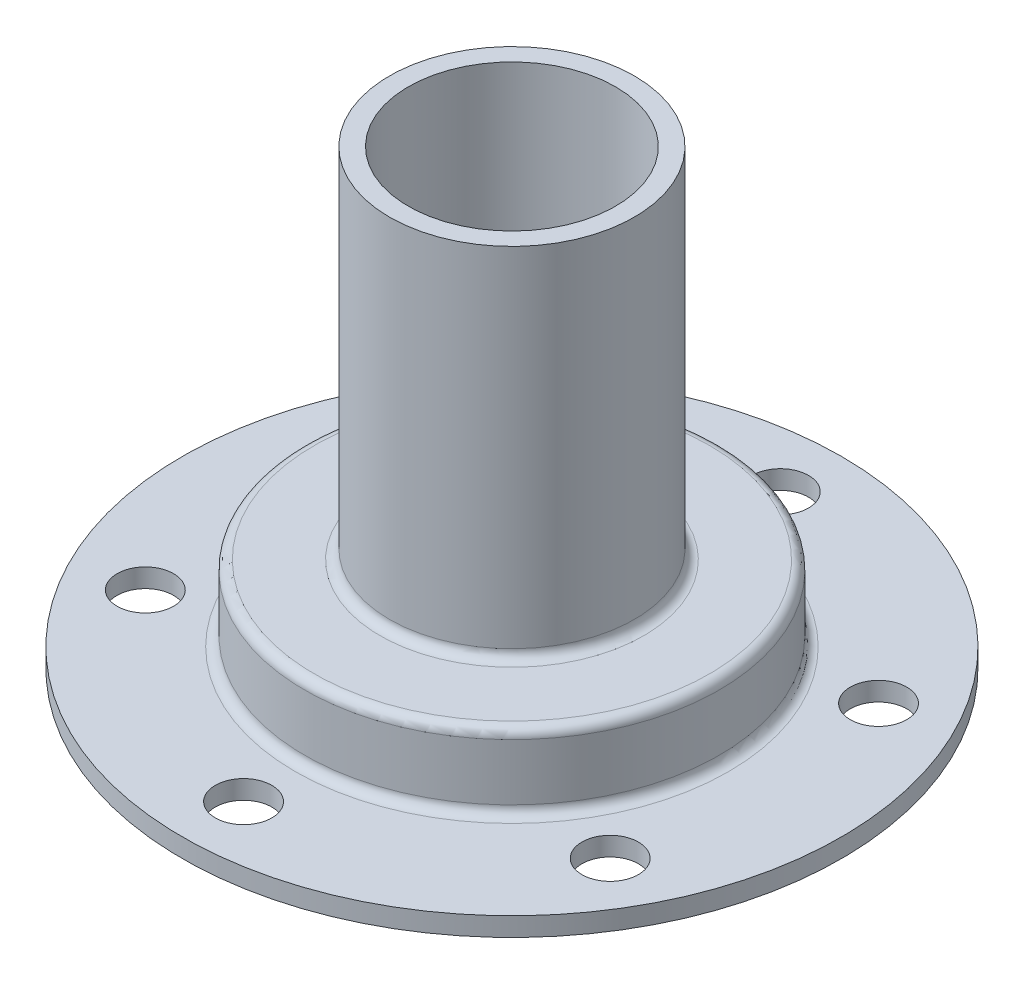
ISO-10303-21;
HEADER;
FILE_DESCRIPTION(('STEP AP214'),'2;1');
FILE_NAME('part.step','',(''),(''),'','','');
FILE_SCHEMA(('AUTOMOTIVE_DESIGN { 1 0 10303 214 1 1 1 1 }'));
ENDSEC;
DATA;
#1=APPLICATION_CONTEXT('core data for automotive mechanical design processes');
#2=APPLICATION_PROTOCOL_DEFINITION('international standard','automotive_design',2000,#1);
#3=PRODUCT_CONTEXT('',#1,'mechanical');
#4=PRODUCT('Part','Part','',(#3));
#5=PRODUCT_RELATED_PRODUCT_CATEGORY('part','',(#4));
#6=PRODUCT_DEFINITION_FORMATION('','',#4);
#7=PRODUCT_DEFINITION_CONTEXT('part definition',#1,'design');
#8=PRODUCT_DEFINITION('design','',#6,#7);
#9=PRODUCT_DEFINITION_SHAPE('','',#8);
#10=(LENGTH_UNIT() NAMED_UNIT(*) SI_UNIT(.MILLI.,.METRE.));
#11=(NAMED_UNIT(*) PLANE_ANGLE_UNIT() SI_UNIT($,.RADIAN.));
#12=(NAMED_UNIT(*) SI_UNIT($,.STERADIAN.) SOLID_ANGLE_UNIT());
#13=UNCERTAINTY_MEASURE_WITH_UNIT(LENGTH_MEASURE(1.E-05),#10,'distance_accuracy_value','');
#14=(GEOMETRIC_REPRESENTATION_CONTEXT(3) GLOBAL_UNCERTAINTY_ASSIGNED_CONTEXT((#13)) GLOBAL_UNIT_ASSIGNED_CONTEXT((#10,
#11,#12)) REPRESENTATION_CONTEXT('',''));
#15=CARTESIAN_POINT('',(0.,0.,0.));
#16=DIRECTION('',(0.,0.,1.));
#17=DIRECTION('',(1.,0.,0.));
#18=AXIS2_PLACEMENT_3D('',#15,#16,#17);
#19=CARTESIAN_POINT('',(0.,0.,0.));
#20=DIRECTION('',(0.,-1.,0.));
#21=DIRECTION('',(0.,0.,-1.));
#22=AXIS2_PLACEMENT_3D('',#19,#20,#21);
#23=CYLINDRICAL_SURFACE('',#22,20.);
#24=CARTESIAN_POINT('',(0.,0.,0.));
#25=DIRECTION('',(0.,-1.,0.));
#26=DIRECTION('',(0.,0.,-1.));
#27=AXIS2_PLACEMENT_3D('',#24,#25,#26);
#28=CIRCLE('',#27,20.);
#29=CARTESIAN_POINT('',(0.,0.,-20.));
#30=VERTEX_POINT('',#29);
#31=EDGE_CURVE('E82',#30,#30,#28,.T.);
#32=ORIENTED_EDGE('',*,*,#31,.T.);
#33=EDGE_LOOP('',(#32));
#34=FACE_BOUND('',#33,.T.);
#35=CARTESIAN_POINT('',(0.,6.99999999999999,0.));
#36=DIRECTION('',(0.,-1.,0.));
#37=DIRECTION('',(0.,0.,-1.));
#38=AXIS2_PLACEMENT_3D('',#35,#36,#37);
#39=CIRCLE('',#38,20.);
#40=CARTESIAN_POINT('',(0.,6.99999999999999,-20.));
#41=VERTEX_POINT('',#40);
#42=EDGE_CURVE('E10',#41,#41,#39,.T.);
#43=ORIENTED_EDGE('',*,*,#42,.F.);
#44=EDGE_LOOP('',(#43));
#45=FACE_BOUND('',#44,.T.);
#46=ADVANCED_FACE('F32',(#34,#45),#23,.F.);
#47=CARTESIAN_POINT('',(0.,7.,0.));
#48=DIRECTION('',(0.,-1.,0.));
#49=DIRECTION('',(0.,0.,-1.));
#50=AXIS2_PLACEMENT_3D('',#47,#48,#49);
#51=TOROIDAL_SURFACE('',#50,19.,1.);
#52=ORIENTED_EDGE('',*,*,#42,.T.);
#53=EDGE_LOOP('',(#52));
#54=FACE_BOUND('',#53,.T.);
#55=CARTESIAN_POINT('',(0.,8.,0.));
#56=DIRECTION('',(0.,-1.,0.));
#57=DIRECTION('',(0.,0.,-1.));
#58=AXIS2_PLACEMENT_3D('',#55,#56,#57);
#59=CIRCLE('',#58,19.);
#60=CARTESIAN_POINT('',(0.,8.,-19.));
#61=VERTEX_POINT('',#60);
#62=EDGE_CURVE('E43',#61,#61,#59,.T.);
#63=ORIENTED_EDGE('',*,*,#62,.F.);
#64=EDGE_LOOP('',(#63));
#65=FACE_BOUND('',#64,.T.);
#66=ADVANCED_FACE('F205',(#54,#65),#51,.F.);
#67=CARTESIAN_POINT('',(11.,8.,0.));
#68=DIRECTION('',(0.,-1.,0.));
#69=DIRECTION('',(0.,0.,-1.));
#70=AXIS2_PLACEMENT_3D('',#67,#68,#69);
#71=PLANE('',#70);
#72=ORIENTED_EDGE('',*,*,#62,.T.);
#73=EDGE_LOOP('',(#72));
#74=FACE_BOUND('',#73,.T.);
#75=CARTESIAN_POINT('',(0.,8.,0.));
#76=DIRECTION('',(0.,-1.,0.));
#77=DIRECTION('',(0.,0.,-1.));
#78=AXIS2_PLACEMENT_3D('',#75,#76,#77);
#79=CIRCLE('',#78,11.);
#80=CARTESIAN_POINT('',(0.,8.,-11.));
#81=VERTEX_POINT('',#80);
#82=EDGE_CURVE('E47',#81,#81,#79,.T.);
#83=ORIENTED_EDGE('',*,*,#82,.F.);
#84=EDGE_LOOP('',(#83));
#85=FACE_BOUND('',#84,.T.);
#86=ADVANCED_FACE('F201',(#74,#85),#71,.T.);
#87=CARTESIAN_POINT('',(0.,0.,0.));
#88=DIRECTION('',(0.,-1.,0.));
#89=DIRECTION('',(0.,0.,-1.));
#90=AXIS2_PLACEMENT_3D('',#87,#88,#89);
#91=CYLINDRICAL_SURFACE('',#90,11.);
#92=CARTESIAN_POINT('',(-10.7121426428143,31.3359961877295,-2.5));
#93=CARTESIAN_POINT('',(-10.7121454314233,31.4744623786841,-2.49999543238962));
#94=CARTESIAN_POINT('',(-10.7148566472694,31.6129822700667,-2.48845712333954));
#95=CARTESIAN_POINT('',(-10.7253866484904,31.8860727627859,-2.44266520236751));
#96=CARTESIAN_POINT('',(-10.7332089369474,32.020640589264,-2.40839601066357));
#97=CARTESIAN_POINT('',(-10.7530304465066,32.281837246103,-2.31828540377217));
#98=CARTESIAN_POINT('',(-10.7650248735991,32.4084749923145,-2.26246873972878));
#99=CARTESIAN_POINT('',(-10.7918333757398,32.6505945874108,-2.13091974990439));
#100=CARTESIAN_POINT('',(-10.8066474399211,32.7660764792877,-2.05518750087741));
#101=CARTESIAN_POINT('',(-10.8377278041731,32.9847116686004,-1.88448528035886));
#102=CARTESIAN_POINT('',(-10.8540139214629,33.0876319681401,-1.78922044020224));
#103=CARTESIAN_POINT('',(-10.8860302886159,33.2761786928387,-1.58279346057436));
#104=CARTESIAN_POINT('',(-10.9017604930117,33.3618037061239,-1.4716300245101));
#105=CARTESIAN_POINT('',(-10.93110941005,33.5142592360016,-1.23499021284435));
#106=CARTESIAN_POINT('',(-10.9447020098483,33.5808643881602,-1.10936512825883));
#107=CARTESIAN_POINT('',(-10.9680197641523,33.6919296061426,-0.84834385563644));
#108=CARTESIAN_POINT('',(-10.9777453878714,33.7363923588599,-0.712948855424521));
#109=CARTESIAN_POINT('',(-10.992093320832,33.8011742834783,-0.438655593897397));
#110=CARTESIAN_POINT('',(-10.9967989680676,33.821888165087,-0.299854987503796));
#111=CARTESIAN_POINT('',(-11.0008659279287,33.8398197208107,-0.0206744590410414));
#112=CARTESIAN_POINT('',(-11.0002278985982,33.8370402879955,0.119705266442305));
#113=CARTESIAN_POINT('',(-10.9937426547597,33.8083554591561,0.395333870912044));
#114=CARTESIAN_POINT('',(-10.9879913110538,33.7828756597158,0.530629631624531));
#115=CARTESIAN_POINT('',(-10.972035500945,33.7101931080781,0.794973031158362));
#116=CARTESIAN_POINT('',(-10.9618308229987,33.6629893239362,0.92402037284203));
#117=CARTESIAN_POINT('',(-10.9379627182996,33.5478307778624,1.17336944375684));
#118=CARTESIAN_POINT('',(-10.9242729764965,33.4797172869938,1.29359524399307));
#119=CARTESIAN_POINT('',(-10.8949317146097,33.3247916757736,1.52106399956616));
#120=CARTESIAN_POINT('',(-10.8792799076932,33.2379768201476,1.62830505215688));
#121=CARTESIAN_POINT('',(-10.8473171066438,33.0458047720662,1.82929354427354));
#122=CARTESIAN_POINT('',(-10.8309992019581,32.9400751769291,1.92268414978478));
#123=CARTESIAN_POINT('',(-10.7998704044976,32.7142853719921,2.09047920073132));
#124=CARTESIAN_POINT('',(-10.7850595594488,32.5942247086145,2.16488304500243));
#125=CARTESIAN_POINT('',(-10.7586016791364,32.3425721996198,2.29276887377835));
#126=CARTESIAN_POINT('',(-10.7469656031437,32.2109424338097,2.3461786596901));
#127=CARTESIAN_POINT('',(-10.7283231226734,31.9402476339902,2.43000958929392));
#128=CARTESIAN_POINT('',(-10.7213159185924,31.8011838886342,2.46043470354816));
#129=CARTESIAN_POINT('',(-10.7128889420635,31.5228419400677,2.49686920193376));
#130=CARTESIAN_POINT('',(-10.7113498101725,31.3836355549158,2.50340025202095));
#131=CARTESIAN_POINT('',(-10.7137104989267,31.1061229795842,2.49327772715816));
#132=CARTESIAN_POINT('',(-10.7176099135701,30.9678167229819,2.47662588287242));
#133=CARTESIAN_POINT('',(-10.7302951733771,30.6978778939211,2.42106417661717));
#134=CARTESIAN_POINT('',(-10.7390169712549,30.5661820209237,2.38244586746638));
#135=CARTESIAN_POINT('',(-10.7603057031402,30.3111305952988,2.28436509536444));
#136=CARTESIAN_POINT('',(-10.7728730289421,30.1877758940603,2.22490050843923));
#137=CARTESIAN_POINT('',(-10.8006961734274,29.9506631486902,2.08568096094998));
#138=CARTESIAN_POINT('',(-10.8159929667106,29.8370972486886,2.00560710889276));
#139=CARTESIAN_POINT('',(-10.847445444588,29.6248228844835,1.82785558175614));
#140=CARTESIAN_POINT('',(-10.8636012445728,29.5261164232109,1.73017553739798));
#141=CARTESIAN_POINT('',(-10.8953477425749,29.3443150897137,1.51761489811828));
#142=CARTESIAN_POINT('',(-10.9109203453324,29.2615772630087,1.40242575322726));
#143=CARTESIAN_POINT('',(-10.9394030007809,29.1166253734245,1.15948167628699));
#144=CARTESIAN_POINT('',(-10.9523131827213,29.054410314164,1.03172735466865));
#145=CARTESIAN_POINT('',(-10.9739405859898,28.9527557766496,0.768105049315912));
#146=CARTESIAN_POINT('',(-10.9826854368624,28.9131658603306,0.632297446270902));
#147=CARTESIAN_POINT('',(-10.9951167589318,28.8574196403752,0.355736283082477));
#148=CARTESIAN_POINT('',(-10.9988040274401,28.8412596430652,0.214983506118724));
#149=CARTESIAN_POINT('',(-11.0006787302882,28.8330090715576,-0.0640926427285491));
#150=CARTESIAN_POINT('',(-10.9989875888252,28.8403871092236,-0.202399752438727));
#151=CARTESIAN_POINT('',(-10.9905580161125,28.8778071364077,-0.475747789729384));
#152=CARTESIAN_POINT('',(-10.9838196900264,28.9078486537076,-0.6107887853024));
#153=CARTESIAN_POINT('',(-10.96606448264,28.9894798269408,-0.87332203421874));
#154=CARTESIAN_POINT('',(-10.9550636655368,29.0409886328309,-1.00084058283969));
#155=CARTESIAN_POINT('',(-10.9299536917879,29.1640154145897,-1.24549315867952));
#156=CARTESIAN_POINT('',(-10.9158442081789,29.2355354954173,-1.36262609174177));
#157=CARTESIAN_POINT('',(-10.8856935133435,29.3982581523724,-1.58575630284182));
#158=CARTESIAN_POINT('',(-10.8696188788032,29.4898311021267,-1.69147898146279));
#159=CARTESIAN_POINT('',(-10.8375213996161,29.6893201580273,-1.88623829979112));
#160=CARTESIAN_POINT('',(-10.8214985685478,29.7972402423146,-1.97527086605942));
#161=CARTESIAN_POINT('',(-10.7910549272231,30.0282681815464,-2.13539007203787));
#162=CARTESIAN_POINT('',(-10.7766611159887,30.151575900585,-2.2061937971019));
#163=CARTESIAN_POINT('',(-10.7514502387736,30.4086450389865,-2.32596037579883));
#164=CARTESIAN_POINT('',(-10.7406302556445,30.5423978217097,-2.37494105401434));
#165=CARTESIAN_POINT('',(-10.72571344068,30.7861641451996,-2.44129910462464));
#166=CARTESIAN_POINT('',(-10.7206593017667,30.8948923603032,-2.46326828297558));
#167=CARTESIAN_POINT('',(-10.7138728814852,31.114401059539,-2.49262014337059));
#168=CARTESIAN_POINT('',(-10.712140411085,31.2251814265234,-2.50000365546745));
#169=CARTESIAN_POINT('',(-10.7121426428143,31.3359961877295,-2.5));
#170=B_SPLINE_CURVE_WITH_KNOTS('',3,(#92,#93,#94,#95,#96,#97,#98,#99,#100,#101,#102,#103,#104,
#105,#106,#107,#108,#109,#110,#111,#112,#113,#114,#115,#116,#117,#118,#119,#120,#121,#122,#123,
#124,#125,#126,#127,#128,#129,#130,#131,#132,#133,#134,#135,#136,#137,#138,#139,#140,#141,#142,
#143,#144,#145,#146,#147,#148,#149,#150,#151,#152,#153,#154,#155,#156,#157,#158,#159,#160,#161,
#162,#163,#164,#165,#166,#167,#168,#169),.UNSPECIFIED.,.T.,.F.,(4,2,2,2,2,2,2,2,2,2,2,2,2,2,2,2,
2,2,2,2,2,2,2,2,2,2,2,2,2,2,2,2,2,2,2,2,2,2,4),(0.,0.414992243301633,0.830269217244779,
1.24507058357679,1.65987035130106,2.08146637272044,2.5030967965796,2.92953338750109,
3.35591821939513,3.77510878183785,4.19424772406961,4.60569006667321,5.01715195585207,
5.43181796836808,5.84654467145158,6.27057865094874,6.69462605466424,7.12011925968861,
7.54553894468119,7.96161330230366,8.37765660054312,8.78830262277904,9.19899049685669,
9.61646120958421,10.0339881436657,10.4599792598124,10.8859496910277,11.3090538013157,
11.7320912029453,12.1456463784943,12.5591929374091,12.9711958750873,13.3832421670976,
13.8036601623803,14.2241806329332,14.6508801056332,15.0772304178392,15.4093684172414,
15.7414875145232),.UNSPECIFIED.);
#171=CARTESIAN_POINT('',(-10.7121426428143,31.3359961877295,-2.5));
#172=VERTEX_POINT('',#171);
#173=EDGE_CURVE('E119',#172,#172,#170,.T.);
#174=ORIENTED_EDGE('',*,*,#173,.F.);
#175=EDGE_LOOP('',(#174));
#176=FACE_BOUND('',#175,.T.);
#177=ORIENTED_EDGE('',*,*,#82,.T.);
#178=EDGE_LOOP('',(#177));
#179=FACE_BOUND('',#178,.T.);
#180=CARTESIAN_POINT('',(0.,48.,0.));
#181=DIRECTION('',(0.,-1.,0.));
#182=DIRECTION('',(0.,0.,-1.));
#183=AXIS2_PLACEMENT_3D('',#180,#181,#182);
#184=CIRCLE('',#183,11.);
#185=CARTESIAN_POINT('',(0.,48.,-11.));
#186=VERTEX_POINT('',#185);
#187=EDGE_CURVE('E52',#186,#186,#184,.T.);
#188=ORIENTED_EDGE('',*,*,#187,.F.);
#189=EDGE_LOOP('',(#188));
#190=FACE_BOUND('',#189,.T.);
#191=ADVANCED_FACE('F126',(#176,#179,#190),#91,.F.);
#192=CARTESIAN_POINT('',(13.,48.,0.));
#193=DIRECTION('',(0.,1.,0.));
#194=DIRECTION('',(0.,0.,1.));
#195=AXIS2_PLACEMENT_3D('',#192,#193,#194);
#196=PLANE('',#195);
#197=ORIENTED_EDGE('',*,*,#187,.T.);
#198=EDGE_LOOP('',(#197));
#199=FACE_BOUND('',#198,.T.);
#200=CARTESIAN_POINT('',(0.,48.,0.));
#201=DIRECTION('',(0.,-1.,0.));
#202=DIRECTION('',(0.,0.,-1.));
#203=AXIS2_PLACEMENT_3D('',#200,#201,#202);
#204=CIRCLE('',#203,13.);
#205=CARTESIAN_POINT('',(0.,48.,-13.));
#206=VERTEX_POINT('',#205);
#207=EDGE_CURVE('E55',#206,#206,#204,.T.);
#208=ORIENTED_EDGE('',*,*,#207,.F.);
#209=EDGE_LOOP('',(#208));
#210=FACE_BOUND('',#209,.T.);
#211=ADVANCED_FACE('F194',(#199,#210),#196,.T.);
#212=CARTESIAN_POINT('',(0.,0.,0.));
#213=DIRECTION('',(0.,-1.,0.));
#214=DIRECTION('',(0.,0.,-1.));
#215=AXIS2_PLACEMENT_3D('',#212,#213,#214);
#216=CYLINDRICAL_SURFACE('',#215,13.);
#217=CARTESIAN_POINT('',(-12.7573508221731,31.3359961877295,-2.5));
#218=CARTESIAN_POINT('',(-12.7573535445971,31.1969703279681,-2.49999473771111));
#219=CARTESIAN_POINT('',(-12.759648106677,31.0578769575464,-2.48836372459743));
#220=CARTESIAN_POINT('',(-12.7685662321878,30.7836171288442,-2.44218113719486));
#221=CARTESIAN_POINT('',(-12.7751933891363,30.648454027671,-2.40761053611891));
#222=CARTESIAN_POINT('',(-12.7919990068767,30.3860625429872,-2.31665374663639));
#223=CARTESIAN_POINT('',(-12.8021740742201,30.258826713905,-2.26028839852833));
#224=CARTESIAN_POINT('',(-12.8249250156472,30.0156236377905,-2.12739803553043));
#225=CARTESIAN_POINT('',(-12.8375007225812,29.8996556070614,-2.05087442406184));
#226=CARTESIAN_POINT('',(-12.8638197867113,29.6807549752933,-1.87877245822431));
#227=CARTESIAN_POINT('',(-12.8775751102276,29.5779912382213,-1.78298111863696));
#228=CARTESIAN_POINT('',(-12.90459798027,29.3898886575819,-1.5755231225806));
#229=CARTESIAN_POINT('',(-12.9178654939172,29.304550986785,-1.46385539849172));
#230=CARTESIAN_POINT('',(-12.9425463769484,29.1530727774719,-1.22670187107625));
#231=CARTESIAN_POINT('',(-12.9539439985905,29.0870919290245,-1.10111228887017));
#232=CARTESIAN_POINT('',(-12.9734667695503,28.9772297624023,-0.840374478610756));
#233=CARTESIAN_POINT('',(-12.9815922019259,28.9333465326097,-0.705227078537798));
#234=CARTESIAN_POINT('',(-12.9935705508999,28.8694487842239,-0.430960845173451));
#235=CARTESIAN_POINT('',(-12.9974744160998,28.8491494126095,-0.291910638125105));
#236=CARTESIAN_POINT('',(-13.0007455117712,28.8321076045074,-0.0123270709409638));
#237=CARTESIAN_POINT('',(-13.000113147748,28.8353630623935,0.128206155502508));
#238=CARTESIAN_POINT('',(-12.9944227232997,28.8651209503354,0.404811580289858));
#239=CARTESIAN_POINT('',(-12.9894230651197,28.8913166208604,0.540918156089657));
#240=CARTESIAN_POINT('',(-12.9756254537905,28.965725642042,0.806767049653698));
#241=CARTESIAN_POINT('',(-12.9668273569848,29.0139398254412,0.936509126506344));
#242=CARTESIAN_POINT('',(-12.9463243258099,29.1313064698736,1.18683036724386));
#243=CARTESIAN_POINT('',(-12.9346025687447,29.2005806330145,1.30735103519341));
#244=CARTESIAN_POINT('',(-12.9095469786328,29.3580109816691,1.53517146817959));
#245=CARTESIAN_POINT('',(-12.8962129735448,29.4461691830552,1.64246981980512));
#246=CARTESIAN_POINT('',(-12.8691545349335,29.6405526968981,1.84261846944045));
#247=CARTESIAN_POINT('',(-12.855427272809,29.7470464219645,1.93520788986346));
#248=CARTESIAN_POINT('',(-12.8293343997587,29.9741863624019,2.10125316353158));
#249=CARTESIAN_POINT('',(-12.8169688108631,30.0948328066824,2.17470870723888));
#250=CARTESIAN_POINT('',(-12.7949946866483,30.3472102050008,2.30048133251873));
#251=CARTESIAN_POINT('',(-12.785391318016,30.4789613428532,2.35275887460557));
#252=CARTESIAN_POINT('',(-12.7701067672006,30.7496037421085,2.43436110074129));
#253=CARTESIAN_POINT('',(-12.7644251156011,30.8884941468259,2.4636885318979));
#254=CARTESIAN_POINT('',(-12.7577206137951,31.1671155123581,2.49817375220936));
#255=CARTESIAN_POINT('',(-12.7566253860666,31.3067983014133,2.50370706985663));
#256=CARTESIAN_POINT('',(-12.7590238308419,31.5850915515992,2.49145509963841));
#257=CARTESIAN_POINT('',(-12.7625172639236,31.7237020682981,2.4736710284025));
#258=CARTESIAN_POINT('',(-12.7736318530023,31.994671130922,2.41561200598846));
#259=CARTESIAN_POINT('',(-12.7812165991315,32.1270737918962,2.37553534674613));
#260=CARTESIAN_POINT('',(-12.7996276252393,32.383285035184,2.27423978654129));
#261=CARTESIAN_POINT('',(-12.8104541548475,32.5070929547654,2.21301925736502));
#262=CARTESIAN_POINT('',(-12.8342928537119,32.7442504301145,2.07031485911768));
#263=CARTESIAN_POINT('',(-12.8473298999345,32.8574552021673,1.9885946122827));
#264=CARTESIAN_POINT('',(-12.8740513624295,33.0686813065955,1.80752787788232));
#265=CARTESIAN_POINT('',(-12.8877358399847,33.1667011978767,1.70817971928817));
#266=CARTESIAN_POINT('',(-12.9144437282901,33.346185939763,1.49299681253014));
#267=CARTESIAN_POINT('',(-12.9274550888692,33.4273977197869,1.37694924353664));
#268=CARTESIAN_POINT('',(-12.951145430407,33.5691714938244,1.13263940226607));
#269=CARTESIAN_POINT('',(-12.9618245043496,33.6297343111262,1.00437761723896));
#270=CARTESIAN_POINT('',(-12.9795953468859,33.7281159175651,0.739966613700503));
#271=CARTESIAN_POINT('',(-12.9867063704086,33.7660569983757,0.603864248412593));
#272=CARTESIAN_POINT('',(-12.9966222021743,33.8185073823497,0.327068775042133));
#273=CARTESIAN_POINT('',(-12.9994274881639,33.8330192851264,0.186376178041926));
#274=CARTESIAN_POINT('',(-13.0004055871504,33.8381050192221,-0.0931827521181667));
#275=CARTESIAN_POINT('',(-12.9986522399737,33.8290604100597,-0.232042028620334));
#276=CARTESIAN_POINT('',(-12.9908642019523,33.7881281075639,-0.506222907249126));
#277=CARTESIAN_POINT('',(-12.9848295568325,33.7562406581951,-0.641544547142218));
#278=CARTESIAN_POINT('',(-12.9691577474469,33.6706919953414,-0.904593549254298));
#279=CARTESIAN_POINT('',(-12.9595276339264,33.617073379378,-1.03233521137864));
#280=CARTESIAN_POINT('',(-12.9377052532993,33.4896310732224,-1.27706488245869));
#281=CARTESIAN_POINT('',(-12.9255128027328,33.4158059361557,-1.39405212054941));
#282=CARTESIAN_POINT('',(-12.8996784805017,33.2487427373997,-1.61584795767645));
#283=CARTESIAN_POINT('',(-12.8860176059801,33.1552300156519,-1.72044748489625));
#284=CARTESIAN_POINT('',(-12.8589033276349,32.9520140051684,-1.91260166612258));
#285=CARTESIAN_POINT('',(-12.8454499734772,32.8423069050496,-2.00015229635294));
#286=CARTESIAN_POINT('',(-12.8201292259648,32.6085263487748,-2.15653452422156));
#287=CARTESIAN_POINT('',(-12.8082786988589,32.4843224288135,-2.22517391596926));
#288=CARTESIAN_POINT('',(-12.7877094152025,32.2259554139782,-2.340501544276));
#289=CARTESIAN_POINT('',(-12.7789877475578,32.0918017173892,-2.3872101977801));
#290=CARTESIAN_POINT('',(-12.7674530961672,31.8537378129842,-2.4480213622143));
#291=CARTESIAN_POINT('',(-12.7636876084207,31.7512082001251,-2.46747939479382));
#292=CARTESIAN_POINT('',(-12.7586354876446,31.5444637413921,-2.49347049397996));
#293=CARTESIAN_POINT('',(-12.7573487806808,31.4402489458755,-2.50000394608695));
#294=CARTESIAN_POINT('',(-12.7573508221731,31.3359961877295,-2.5));
#295=B_SPLINE_CURVE_WITH_KNOTS('',3,(#217,#218,#219,#220,#221,#222,#223,#224,#225,#226,#227,
#228,#229,#230,#231,#232,#233,#234,#235,#236,#237,#238,#239,#240,#241,#242,#243,#244,#245,#246,
#247,#248,#249,#250,#251,#252,#253,#254,#255,#256,#257,#258,#259,#260,#261,#262,#263,#264,#265,
#266,#267,#268,#269,#270,#271,#272,#273,#274,#275,#276,#277,#278,#279,#280,#281,#282,#283,#284,
#285,#286,#287,#288,#289,#290,#291,#292,#293,#294),.UNSPECIFIED.,.T.,.F.,(4,2,2,2,2,2,2,2,2,2,2,
2,2,2,2,2,2,2,2,2,2,2,2,2,2,2,2,2,2,2,2,2,2,2,2,2,2,2,4),(0.,0.416695988880008,
0.833738030737637,1.25038227614466,1.66699752238094,2.08849971831381,2.5100302719089,
2.93494642182602,3.35982580683554,3.77951819081206,4.19917305788035,4.61330049028081,
5.02744358632398,5.44402696725573,5.8606548406758,6.28400091938149,6.70735384633274,
7.13149357344848,7.55558252364952,7.97295317898353,8.39030205806815,8.80399666093121,
9.21772312804067,9.63645909210583,10.0552347712562,10.4799185943274,10.9045854829869,
11.32693532976,11.7492383109661,12.1647436860035,12.5802446234503,12.9949350033565,
13.4096550846627,13.8305978202814,14.251639784134,14.6768151908599,15.1015939816585,
15.4140754294552,15.7265475567532),.UNSPECIFIED.);
#296=CARTESIAN_POINT('',(-12.7573508221731,31.3359961877295,-2.5));
#297=VERTEX_POINT('',#296);
#298=EDGE_CURVE('E35',#297,#297,#295,.T.);
#299=ORIENTED_EDGE('',*,*,#298,.F.);
#300=EDGE_LOOP('',(#299));
#301=FACE_BOUND('',#300,.T.);
#302=ORIENTED_EDGE('',*,*,#207,.T.);
#303=EDGE_LOOP('',(#302));
#304=FACE_BOUND('',#303,.T.);
#305=CARTESIAN_POINT('',(0.,11.,0.));
#306=DIRECTION('',(0.,-1.,0.));
#307=DIRECTION('',(0.,0.,-1.));
#308=AXIS2_PLACEMENT_3D('',#305,#306,#307);
#309=CIRCLE('',#308,13.);
#310=CARTESIAN_POINT('',(0.,11.,-13.));
#311=VERTEX_POINT('',#310);
#312=EDGE_CURVE('E58',#311,#311,#309,.T.);
#313=ORIENTED_EDGE('',*,*,#312,.F.);
#314=EDGE_LOOP('',(#313));
#315=FACE_BOUND('',#314,.T.);
#316=ADVANCED_FACE('F190',(#301,#304,#315),#216,.T.);
#317=CARTESIAN_POINT('',(0.,11.,0.));
#318=DIRECTION('',(0.,-1.,0.));
#319=DIRECTION('',(0.,0.,-1.));
#320=AXIS2_PLACEMENT_3D('',#317,#318,#319);
#321=TOROIDAL_SURFACE('',#320,14.,1.);
#322=ORIENTED_EDGE('',*,*,#312,.T.);
#323=EDGE_LOOP('',(#322));
#324=FACE_BOUND('',#323,.T.);
#325=CARTESIAN_POINT('',(0.,10.,0.));
#326=DIRECTION('',(0.,-1.,0.));
#327=DIRECTION('',(0.,0.,-1.));
#328=AXIS2_PLACEMENT_3D('',#325,#326,#327);
#329=CIRCLE('',#328,14.);
#330=CARTESIAN_POINT('',(0.,10.,-14.));
#331=VERTEX_POINT('',#330);
#332=EDGE_CURVE('E61',#331,#331,#329,.T.);
#333=ORIENTED_EDGE('',*,*,#332,.F.);
#334=EDGE_LOOP('',(#333));
#335=FACE_BOUND('',#334,.T.);
#336=ADVANCED_FACE('F187',(#324,#335),#321,.F.);
#337=CARTESIAN_POINT('',(21.,10.,0.));
#338=DIRECTION('',(0.,1.,0.));
#339=DIRECTION('',(0.,0.,1.));
#340=AXIS2_PLACEMENT_3D('',#337,#338,#339);
#341=PLANE('',#340);
#342=ORIENTED_EDGE('',*,*,#332,.T.);
#343=EDGE_LOOP('',(#342));
#344=FACE_BOUND('',#343,.T.);
#345=CARTESIAN_POINT('',(0.,10.,0.));
#346=DIRECTION('',(0.,-1.,0.));
#347=DIRECTION('',(0.,0.,-1.));
#348=AXIS2_PLACEMENT_3D('',#345,#346,#347);
#349=CIRCLE('',#348,21.);
#350=CARTESIAN_POINT('',(0.,10.,-21.));
#351=VERTEX_POINT('',#350);
#352=EDGE_CURVE('E64',#351,#351,#349,.T.);
#353=ORIENTED_EDGE('',*,*,#352,.F.);
#354=EDGE_LOOP('',(#353));
#355=FACE_BOUND('',#354,.T.);
#356=ADVANCED_FACE('F183',(#344,#355),#341,.T.);
#357=CARTESIAN_POINT('',(0.,9.,0.));
#358=DIRECTION('',(0.,-1.,0.));
#359=DIRECTION('',(0.,0.,-1.));
#360=AXIS2_PLACEMENT_3D('',#357,#358,#359);
#361=TOROIDAL_SURFACE('',#360,21.,1.);
#362=ORIENTED_EDGE('',*,*,#352,.T.);
#363=EDGE_LOOP('',(#362));
#364=FACE_BOUND('',#363,.T.);
#365=CARTESIAN_POINT('',(0.,8.99999999999999,0.));
#366=DIRECTION('',(0.,-1.,0.));
#367=DIRECTION('',(0.,0.,-1.));
#368=AXIS2_PLACEMENT_3D('',#365,#366,#367);
#369=CIRCLE('',#368,22.);
#370=CARTESIAN_POINT('',(0.,8.99999999999999,-22.));
#371=VERTEX_POINT('',#370);
#372=EDGE_CURVE('E67',#371,#371,#369,.T.);
#373=ORIENTED_EDGE('',*,*,#372,.F.);
#374=EDGE_LOOP('',(#373));
#375=FACE_BOUND('',#374,.T.);
#376=ADVANCED_FACE('F179',(#364,#375),#361,.T.);
#377=CARTESIAN_POINT('',(0.,0.,0.));
#378=DIRECTION('',(0.,-1.,0.));
#379=DIRECTION('',(0.,0.,-1.));
#380=AXIS2_PLACEMENT_3D('',#377,#378,#379);
#381=CYLINDRICAL_SURFACE('',#380,22.);
#382=ORIENTED_EDGE('',*,*,#372,.T.);
#383=EDGE_LOOP('',(#382));
#384=FACE_BOUND('',#383,.T.);
#385=CARTESIAN_POINT('',(0.,3.00000000000001,0.));
#386=DIRECTION('',(0.,-1.,0.));
#387=DIRECTION('',(0.,0.,-1.));
#388=AXIS2_PLACEMENT_3D('',#385,#386,#387);
#389=CIRCLE('',#388,22.);
#390=CARTESIAN_POINT('',(0.,3.00000000000001,-22.));
#391=VERTEX_POINT('',#390);
#392=EDGE_CURVE('E70',#391,#391,#389,.T.);
#393=ORIENTED_EDGE('',*,*,#392,.F.);
#394=EDGE_LOOP('',(#393));
#395=FACE_BOUND('',#394,.T.);
#396=ADVANCED_FACE('F175',(#384,#395),#381,.T.);
#397=CARTESIAN_POINT('',(0.,3.,0.));
#398=DIRECTION('',(0.,-1.,0.));
#399=DIRECTION('',(0.,0.,-1.));
#400=AXIS2_PLACEMENT_3D('',#397,#398,#399);
#401=TOROIDAL_SURFACE('',#400,23.,1.);
#402=ORIENTED_EDGE('',*,*,#392,.T.);
#403=EDGE_LOOP('',(#402));
#404=FACE_BOUND('',#403,.T.);
#405=CARTESIAN_POINT('',(0.,2.,0.));
#406=DIRECTION('',(0.,-1.,0.));
#407=DIRECTION('',(0.,0.,-1.));
#408=AXIS2_PLACEMENT_3D('',#405,#406,#407);
#409=CIRCLE('',#408,23.);
#410=CARTESIAN_POINT('',(0.,2.,-23.));
#411=VERTEX_POINT('',#410);
#412=EDGE_CURVE('E73',#411,#411,#409,.T.);
#413=ORIENTED_EDGE('',*,*,#412,.F.);
#414=EDGE_LOOP('',(#413));
#415=FACE_BOUND('',#414,.T.);
#416=ADVANCED_FACE('F171',(#404,#415),#401,.F.);
#417=CARTESIAN_POINT('',(35.,2.,0.));
#418=DIRECTION('',(0.,1.,0.));
#419=DIRECTION('',(0.,0.,1.));
#420=AXIS2_PLACEMENT_3D('',#417,#418,#419);
#421=PLANE('',#420);
#422=CARTESIAN_POINT('',(-24.6817240078553,2.,-14.249999999998));
#423=DIRECTION('',(0.,1.,0.));
#424=DIRECTION('',(0.,0.,1.));
#425=AXIS2_PLACEMENT_3D('',#422,#423,#424);
#426=CIRCLE('',#425,3.);
#427=CARTESIAN_POINT('',(-24.6817240078553,2.,-11.249999999998));
#428=VERTEX_POINT('',#427);
#429=EDGE_CURVE('E116',#428,#428,#426,.T.);
#430=ORIENTED_EDGE('',*,*,#429,.F.);
#431=EDGE_LOOP('',(#430));
#432=FACE_BOUND('',#431,.T.);
#433=CARTESIAN_POINT('',(-24.681724007853,2.,14.250000000002));
#434=DIRECTION('',(0.,1.,0.));
#435=DIRECTION('',(0.,0.,1.));
#436=AXIS2_PLACEMENT_3D('',#433,#434,#435);
#437=CIRCLE('',#436,3.);
#438=CARTESIAN_POINT('',(-24.681724007853,2.,17.250000000002));
#439=VERTEX_POINT('',#438);
#440=EDGE_CURVE('E110',#439,#439,#437,.T.);
#441=ORIENTED_EDGE('',*,*,#440,.F.);
#442=EDGE_LOOP('',(#441));
#443=FACE_BOUND('',#442,.T.);
#444=CARTESIAN_POINT('',(4.6728656272083E-12,2.,28.5));
#445=DIRECTION('',(0.,1.,0.));
#446=DIRECTION('',(0.,0.,1.));
#447=AXIS2_PLACEMENT_3D('',#444,#445,#446);
#448=CIRCLE('',#447,3.);
#449=CARTESIAN_POINT('',(4.6728656272083E-12,2.,31.5));
#450=VERTEX_POINT('',#449);
#451=EDGE_CURVE('E104',#450,#450,#448,.T.);
#452=ORIENTED_EDGE('',*,*,#451,.F.);
#453=EDGE_LOOP('',(#452));
#454=FACE_BOUND('',#453,.T.);
#455=CARTESIAN_POINT('',(24.68172400786,2.,14.249999999998));
#456=DIRECTION('',(0.,1.,0.));
#457=DIRECTION('',(0.,0.,1.));
#458=AXIS2_PLACEMENT_3D('',#455,#456,#457);
#459=CIRCLE('',#458,3.);
#460=CARTESIAN_POINT('',(24.68172400786,2.,17.249999999998));
#461=VERTEX_POINT('',#460);
#462=EDGE_CURVE('E98',#461,#461,#459,.T.);
#463=ORIENTED_EDGE('',*,*,#462,.F.);
#464=EDGE_LOOP('',(#463));
#465=FACE_BOUND('',#464,.T.);
#466=CARTESIAN_POINT('',(24.6817240078577,2.,-14.250000000002));
#467=DIRECTION('',(0.,1.,0.));
#468=DIRECTION('',(0.,0.,1.));
#469=AXIS2_PLACEMENT_3D('',#466,#467,#468);
#470=CIRCLE('',#469,2.99999999999999);
#471=CARTESIAN_POINT('',(24.6817240078577,2.,-11.250000000002));
#472=VERTEX_POINT('',#471);
#473=EDGE_CURVE('E92',#472,#472,#470,.T.);
#474=ORIENTED_EDGE('',*,*,#473,.F.);
#475=EDGE_LOOP('',(#474));
#476=FACE_BOUND('',#475,.T.);
#477=CARTESIAN_POINT('',(0.,2.,-28.5));
#478=DIRECTION('',(0.,1.,0.));
#479=DIRECTION('',(0.,0.,1.));
#480=AXIS2_PLACEMENT_3D('',#477,#478,#479);
#481=CIRCLE('',#480,3.);
#482=CARTESIAN_POINT('',(0.,2.,-25.5));
#483=VERTEX_POINT('',#482);
#484=EDGE_CURVE('E86',#483,#483,#481,.T.);
#485=ORIENTED_EDGE('',*,*,#484,.F.);
#486=EDGE_LOOP('',(#485));
#487=FACE_BOUND('',#486,.T.);
#488=ORIENTED_EDGE('',*,*,#412,.T.);
#489=EDGE_LOOP('',(#488));
#490=FACE_BOUND('',#489,.T.);
#491=CARTESIAN_POINT('',(0.,2.,0.));
#492=DIRECTION('',(0.,-1.,0.));
#493=DIRECTION('',(0.,0.,-1.));
#494=AXIS2_PLACEMENT_3D('',#491,#492,#493);
#495=CIRCLE('',#494,35.);
#496=CARTESIAN_POINT('',(0.,2.,-35.));
#497=VERTEX_POINT('',#496);
#498=EDGE_CURVE('E76',#497,#497,#495,.T.);
#499=ORIENTED_EDGE('',*,*,#498,.F.);
#500=EDGE_LOOP('',(#499));
#501=FACE_BOUND('',#500,.T.);
#502=ADVANCED_FACE('F167',(#432,#443,#454,#465,#476,#487,#490,#501),#421,.T.);
#503=CARTESIAN_POINT('',(0.,0.,0.));
#504=DIRECTION('',(0.,-1.,0.));
#505=DIRECTION('',(0.,0.,-1.));
#506=AXIS2_PLACEMENT_3D('',#503,#504,#505);
#507=CYLINDRICAL_SURFACE('',#506,35.);
#508=ORIENTED_EDGE('',*,*,#498,.T.);
#509=EDGE_LOOP('',(#508));
#510=FACE_BOUND('',#509,.T.);
#511=CARTESIAN_POINT('',(0.,0.,0.));
#512=DIRECTION('',(0.,-1.,0.));
#513=DIRECTION('',(0.,0.,-1.));
#514=AXIS2_PLACEMENT_3D('',#511,#512,#513);
#515=CIRCLE('',#514,35.);
#516=CARTESIAN_POINT('',(0.,0.,-35.));
#517=VERTEX_POINT('',#516);
#518=EDGE_CURVE('E79',#517,#517,#515,.T.);
#519=ORIENTED_EDGE('',*,*,#518,.F.);
#520=EDGE_LOOP('',(#519));
#521=FACE_BOUND('',#520,.T.);
#522=ADVANCED_FACE('F163',(#510,#521),#507,.T.);
#523=CARTESIAN_POINT('',(20.,0.,0.));
#524=DIRECTION('',(0.,-1.,0.));
#525=DIRECTION('',(0.,0.,-1.));
#526=AXIS2_PLACEMENT_3D('',#523,#524,#525);
#527=PLANE('',#526);
#528=CARTESIAN_POINT('',(-24.6817240078553,0.,-14.249999999998));
#529=DIRECTION('',(0.,1.,0.));
#530=DIRECTION('',(0.,0.,1.));
#531=AXIS2_PLACEMENT_3D('',#528,#529,#530);
#532=CIRCLE('',#531,3.);
#533=CARTESIAN_POINT('',(-24.6817240078553,0.,-11.249999999998));
#534=VERTEX_POINT('',#533);
#535=EDGE_CURVE('E113',#534,#534,#532,.T.);
#536=ORIENTED_EDGE('',*,*,#535,.T.);
#537=EDGE_LOOP('',(#536));
#538=FACE_BOUND('',#537,.T.);
#539=CARTESIAN_POINT('',(-24.681724007853,0.,14.250000000002));
#540=DIRECTION('',(0.,1.,0.));
#541=DIRECTION('',(0.,0.,1.));
#542=AXIS2_PLACEMENT_3D('',#539,#540,#541);
#543=CIRCLE('',#542,3.);
#544=CARTESIAN_POINT('',(-24.681724007853,0.,17.250000000002));
#545=VERTEX_POINT('',#544);
#546=EDGE_CURVE('E107',#545,#545,#543,.T.);
#547=ORIENTED_EDGE('',*,*,#546,.T.);
#548=EDGE_LOOP('',(#547));
#549=FACE_BOUND('',#548,.T.);
#550=CARTESIAN_POINT('',(4.6728656272083E-12,0.,28.5));
#551=DIRECTION('',(0.,1.,0.));
#552=DIRECTION('',(0.,0.,1.));
#553=AXIS2_PLACEMENT_3D('',#550,#551,#552);
#554=CIRCLE('',#553,3.);
#555=CARTESIAN_POINT('',(4.6728656272083E-12,0.,31.5));
#556=VERTEX_POINT('',#555);
#557=EDGE_CURVE('E101',#556,#556,#554,.T.);
#558=ORIENTED_EDGE('',*,*,#557,.T.);
#559=EDGE_LOOP('',(#558));
#560=FACE_BOUND('',#559,.T.);
#561=CARTESIAN_POINT('',(24.68172400786,0.,14.249999999998));
#562=DIRECTION('',(0.,1.,0.));
#563=DIRECTION('',(0.,0.,1.));
#564=AXIS2_PLACEMENT_3D('',#561,#562,#563);
#565=CIRCLE('',#564,3.);
#566=CARTESIAN_POINT('',(24.68172400786,0.,17.249999999998));
#567=VERTEX_POINT('',#566);
#568=EDGE_CURVE('E95',#567,#567,#565,.T.);
#569=ORIENTED_EDGE('',*,*,#568,.T.);
#570=EDGE_LOOP('',(#569));
#571=FACE_BOUND('',#570,.T.);
#572=CARTESIAN_POINT('',(24.6817240078577,0.,-14.250000000002));
#573=DIRECTION('',(0.,1.,0.));
#574=DIRECTION('',(0.,0.,1.));
#575=AXIS2_PLACEMENT_3D('',#572,#573,#574);
#576=CIRCLE('',#575,2.99999999999999);
#577=CARTESIAN_POINT('',(24.6817240078577,0.,-11.250000000002));
#578=VERTEX_POINT('',#577);
#579=EDGE_CURVE('E89',#578,#578,#576,.T.);
#580=ORIENTED_EDGE('',*,*,#579,.T.);
#581=EDGE_LOOP('',(#580));
#582=FACE_BOUND('',#581,.T.);
#583=CARTESIAN_POINT('',(0.,0.,-28.5));
#584=DIRECTION('',(0.,1.,0.));
#585=DIRECTION('',(0.,0.,1.));
#586=AXIS2_PLACEMENT_3D('',#583,#584,#585);
#587=CIRCLE('',#586,3.);
#588=CARTESIAN_POINT('',(0.,0.,-25.5));
#589=VERTEX_POINT('',#588);
#590=EDGE_CURVE('E85',#589,#589,#587,.T.);
#591=ORIENTED_EDGE('',*,*,#590,.T.);
#592=EDGE_LOOP('',(#591));
#593=FACE_BOUND('',#592,.T.);
#594=ORIENTED_EDGE('',*,*,#518,.T.);
#595=EDGE_LOOP('',(#594));
#596=FACE_BOUND('',#595,.T.);
#597=ORIENTED_EDGE('',*,*,#31,.F.);
#598=EDGE_LOOP('',(#597));
#599=FACE_BOUND('',#598,.T.);
#600=ADVANCED_FACE('F159',(#538,#549,#560,#571,#582,#593,#596,#599),#527,.T.);
#601=CARTESIAN_POINT('',(0.,0.,-28.5));
#602=DIRECTION('',(0.,1.,0.));
#603=DIRECTION('',(0.,0.,1.));
#604=AXIS2_PLACEMENT_3D('',#601,#602,#603);
#605=CYLINDRICAL_SURFACE('',#604,3.);
#606=ORIENTED_EDGE('',*,*,#590,.F.);
#607=EDGE_LOOP('',(#606));
#608=FACE_BOUND('',#607,.T.);
#609=ORIENTED_EDGE('',*,*,#484,.T.);
#610=EDGE_LOOP('',(#609));
#611=FACE_BOUND('',#610,.T.);
#612=ADVANCED_FACE('F155',(#608,#611),#605,.F.);
#613=CARTESIAN_POINT('',(24.6817240078577,0.,-14.250000000002));
#614=DIRECTION('',(0.,1.,0.));
#615=DIRECTION('',(0.,0.,1.));
#616=AXIS2_PLACEMENT_3D('',#613,#614,#615);
#617=CYLINDRICAL_SURFACE('',#616,2.99999999999999);
#618=ORIENTED_EDGE('',*,*,#579,.F.);
#619=EDGE_LOOP('',(#618));
#620=FACE_BOUND('',#619,.T.);
#621=ORIENTED_EDGE('',*,*,#473,.T.);
#622=EDGE_LOOP('',(#621));
#623=FACE_BOUND('',#622,.T.);
#624=ADVANCED_FACE('F151',(#620,#623),#617,.F.);
#625=CARTESIAN_POINT('',(24.68172400786,0.,14.249999999998));
#626=DIRECTION('',(0.,1.,0.));
#627=DIRECTION('',(0.,0.,1.));
#628=AXIS2_PLACEMENT_3D('',#625,#626,#627);
#629=CYLINDRICAL_SURFACE('',#628,3.);
#630=ORIENTED_EDGE('',*,*,#568,.F.);
#631=EDGE_LOOP('',(#630));
#632=FACE_BOUND('',#631,.T.);
#633=ORIENTED_EDGE('',*,*,#462,.T.);
#634=EDGE_LOOP('',(#633));
#635=FACE_BOUND('',#634,.T.);
#636=ADVANCED_FACE('F147',(#632,#635),#629,.F.);
#637=CARTESIAN_POINT('',(4.6728656272083E-12,0.,28.5));
#638=DIRECTION('',(0.,1.,0.));
#639=DIRECTION('',(0.,0.,1.));
#640=AXIS2_PLACEMENT_3D('',#637,#638,#639);
#641=CYLINDRICAL_SURFACE('',#640,3.);
#642=ORIENTED_EDGE('',*,*,#557,.F.);
#643=EDGE_LOOP('',(#642));
#644=FACE_BOUND('',#643,.T.);
#645=ORIENTED_EDGE('',*,*,#451,.T.);
#646=EDGE_LOOP('',(#645));
#647=FACE_BOUND('',#646,.T.);
#648=ADVANCED_FACE('F143',(#644,#647),#641,.F.);
#649=CARTESIAN_POINT('',(-24.681724007853,0.,14.250000000002));
#650=DIRECTION('',(0.,1.,0.));
#651=DIRECTION('',(0.,0.,1.));
#652=AXIS2_PLACEMENT_3D('',#649,#650,#651);
#653=CYLINDRICAL_SURFACE('',#652,3.);
#654=ORIENTED_EDGE('',*,*,#546,.F.);
#655=EDGE_LOOP('',(#654));
#656=FACE_BOUND('',#655,.T.);
#657=ORIENTED_EDGE('',*,*,#440,.T.);
#658=EDGE_LOOP('',(#657));
#659=FACE_BOUND('',#658,.T.);
#660=ADVANCED_FACE('F139',(#656,#659),#653,.F.);
#661=CARTESIAN_POINT('',(-24.6817240078553,0.,-14.249999999998));
#662=DIRECTION('',(0.,1.,0.));
#663=DIRECTION('',(0.,0.,1.));
#664=AXIS2_PLACEMENT_3D('',#661,#662,#663);
#665=CYLINDRICAL_SURFACE('',#664,3.);
#666=ORIENTED_EDGE('',*,*,#535,.F.);
#667=EDGE_LOOP('',(#666));
#668=FACE_BOUND('',#667,.T.);
#669=ORIENTED_EDGE('',*,*,#429,.T.);
#670=EDGE_LOOP('',(#669));
#671=FACE_BOUND('',#670,.T.);
#672=ADVANCED_FACE('F134',(#668,#671),#665,.F.);
#673=CARTESIAN_POINT('',(-35.,31.3359961877295,0.));
#674=DIRECTION('',(1.,0.,0.));
#675=DIRECTION('',(0.,0.,-1.));
#676=AXIS2_PLACEMENT_3D('',#673,#674,#675);
#677=CYLINDRICAL_SURFACE('',#676,2.5);
#678=ORIENTED_EDGE('',*,*,#173,.T.);
#679=EDGE_LOOP('',(#678));
#680=FACE_BOUND('',#679,.T.);
#681=ORIENTED_EDGE('',*,*,#298,.T.);
#682=EDGE_LOOP('',(#681));
#683=FACE_BOUND('',#682,.T.);
#684=ADVANCED_FACE('F130',(#680,#683),#677,.F.);
#685=CLOSED_SHELL('',(#46,#66,#86,#191,#211,#316,#336,#356,#376,#396,#416,#502,#522,#600,#612,
#624,#636,#648,#660,#672,#684));
#686=MANIFOLD_SOLID_BREP('B2',#685);
#687=ADVANCED_BREP_SHAPE_REPRESENTATION('',(#18,#686),#14);
#688=SHAPE_DEFINITION_REPRESENTATION(#9,#687);
ENDSEC;
END-ISO-10303-21;
